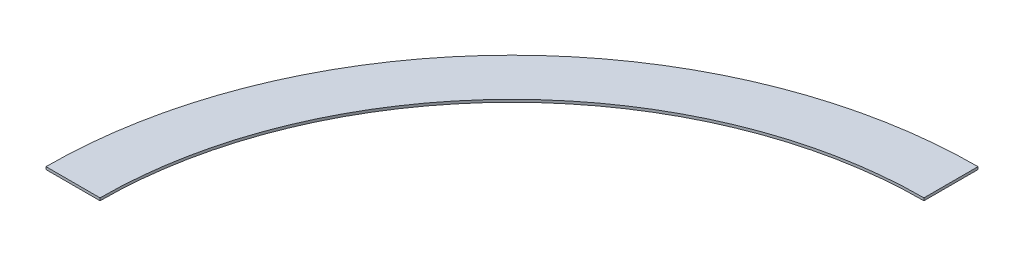
ISO-10303-21;
HEADER;
FILE_DESCRIPTION(('STEP AP214'),'2;1');
FILE_NAME('part.step','',(''),(''),'','','');
FILE_SCHEMA(('AUTOMOTIVE_DESIGN { 1 0 10303 214 1 1 1 1 }'));
ENDSEC;
DATA;
#1=APPLICATION_CONTEXT('core data for automotive mechanical design processes');
#2=APPLICATION_PROTOCOL_DEFINITION('international standard','automotive_design',2000,#1);
#3=PRODUCT_CONTEXT('',#1,'mechanical');
#4=PRODUCT('Part','Part','',(#3));
#5=PRODUCT_RELATED_PRODUCT_CATEGORY('part','',(#4));
#6=PRODUCT_DEFINITION_FORMATION('','',#4);
#7=PRODUCT_DEFINITION_CONTEXT('part definition',#1,'design');
#8=PRODUCT_DEFINITION('design','',#6,#7);
#9=PRODUCT_DEFINITION_SHAPE('','',#8);
#10=(LENGTH_UNIT() NAMED_UNIT(*) SI_UNIT(.MILLI.,.METRE.));
#11=(NAMED_UNIT(*) PLANE_ANGLE_UNIT() SI_UNIT($,.RADIAN.));
#12=(NAMED_UNIT(*) SI_UNIT($,.STERADIAN.) SOLID_ANGLE_UNIT());
#13=UNCERTAINTY_MEASURE_WITH_UNIT(LENGTH_MEASURE(1.E-05),#10,'distance_accuracy_value','');
#14=(GEOMETRIC_REPRESENTATION_CONTEXT(3) GLOBAL_UNCERTAINTY_ASSIGNED_CONTEXT((#13)) GLOBAL_UNIT_ASSIGNED_CONTEXT((#10,
#11,#12)) REPRESENTATION_CONTEXT('',''));
#15=CARTESIAN_POINT('',(0.,0.,0.));
#16=DIRECTION('',(0.,0.,1.));
#17=DIRECTION('',(1.,0.,0.));
#18=AXIS2_PLACEMENT_3D('',#15,#16,#17);
#19=CARTESIAN_POINT('',(0.,1.,0.));
#20=DIRECTION('',(1.,0.,0.));
#21=DIRECTION('',(0.,0.,-1.));
#22=AXIS2_PLACEMENT_3D('',#19,#20,#21);
#23=PLANE('',#22);
#24=DIRECTION('',(0.,0.,1.));
#25=VECTOR('',#24,1.);
#26=CARTESIAN_POINT('',(0.,0.,0.));
#27=LINE('',#26,#25);
#28=CARTESIAN_POINT('',(0.,0.,-181.));
#29=VERTEX_POINT('',#28);
#30=CARTESIAN_POINT('',(0.,0.,-160.));
#31=VERTEX_POINT('',#30);
#32=EDGE_CURVE('E98',#29,#31,#27,.T.);
#33=ORIENTED_EDGE('',*,*,#32,.F.);
#34=DIRECTION('',(0.,-1.,0.));
#35=VECTOR('',#34,1.);
#36=CARTESIAN_POINT('',(0.,1.,-181.));
#37=LINE('',#36,#35);
#38=CARTESIAN_POINT('',(0.,1.,-181.));
#39=VERTEX_POINT('',#38);
#40=EDGE_CURVE('E11',#39,#29,#37,.T.);
#41=ORIENTED_EDGE('',*,*,#40,.F.);
#42=DIRECTION('',(0.,0.,1.));
#43=VECTOR('',#42,1.);
#44=CARTESIAN_POINT('',(0.,1.,0.));
#45=LINE('',#44,#43);
#46=CARTESIAN_POINT('',(0.,1.,-160.));
#47=VERTEX_POINT('',#46);
#48=EDGE_CURVE('E83',#39,#47,#45,.T.);
#49=ORIENTED_EDGE('',*,*,#48,.T.);
#50=DIRECTION('',(0.,-1.,0.));
#51=VECTOR('',#50,1.);
#52=CARTESIAN_POINT('',(0.,1.,-160.));
#53=LINE('',#52,#51);
#54=EDGE_CURVE('E51',#47,#31,#53,.T.);
#55=ORIENTED_EDGE('',*,*,#54,.T.);
#56=EDGE_LOOP('',(#33,#41,#49,#55));
#57=FACE_BOUND('',#56,.T.);
#58=ADVANCED_FACE('F35',(#57),#23,.T.);
#59=CARTESIAN_POINT('',(0.,1.,0.));
#60=DIRECTION('',(0.,-1.,0.));
#61=DIRECTION('',(0.,0.,-1.));
#62=AXIS2_PLACEMENT_3D('',#59,#60,#61);
#63=CYLINDRICAL_SURFACE('',#62,181.);
#64=CARTESIAN_POINT('',(0.,0.,0.));
#65=DIRECTION('',(0.,1.,0.));
#66=DIRECTION('',(0.,0.,1.));
#67=AXIS2_PLACEMENT_3D('',#64,#65,#66);
#68=CIRCLE('',#67,181.);
#69=CARTESIAN_POINT('',(-181.,0.,0.));
#70=VERTEX_POINT('',#69);
#71=EDGE_CURVE('E89',#29,#70,#68,.T.);
#72=ORIENTED_EDGE('',*,*,#71,.T.);
#73=DIRECTION('',(0.,-1.,0.));
#74=VECTOR('',#73,1.);
#75=CARTESIAN_POINT('',(-181.,1.,0.));
#76=LINE('',#75,#74);
#77=CARTESIAN_POINT('',(-181.,1.,0.));
#78=VERTEX_POINT('',#77);
#79=EDGE_CURVE('E43',#78,#70,#76,.T.);
#80=ORIENTED_EDGE('',*,*,#79,.F.);
#81=CARTESIAN_POINT('',(0.,1.,0.));
#82=DIRECTION('',(0.,1.,0.));
#83=DIRECTION('',(0.,0.,1.));
#84=AXIS2_PLACEMENT_3D('',#81,#82,#83);
#85=CIRCLE('',#84,181.);
#86=EDGE_CURVE('E77',#39,#78,#85,.T.);
#87=ORIENTED_EDGE('',*,*,#86,.F.);
#88=ORIENTED_EDGE('',*,*,#40,.T.);
#89=EDGE_LOOP('',(#72,#80,#87,#88));
#90=FACE_BOUND('',#89,.T.);
#91=ADVANCED_FACE('F87',(#90),#63,.T.);
#92=CARTESIAN_POINT('',(0.,1.,0.));
#93=DIRECTION('',(0.,0.,1.));
#94=DIRECTION('',(1.,0.,0.));
#95=AXIS2_PLACEMENT_3D('',#92,#93,#94);
#96=PLANE('',#95);
#97=DIRECTION('',(-1.,0.,0.));
#98=VECTOR('',#97,1.);
#99=CARTESIAN_POINT('',(0.,0.,0.));
#100=LINE('',#99,#98);
#101=CARTESIAN_POINT('',(-160.,0.,0.));
#102=VERTEX_POINT('',#101);
#103=EDGE_CURVE('E101',#102,#70,#100,.T.);
#104=ORIENTED_EDGE('',*,*,#103,.F.);
#105=DIRECTION('',(0.,-1.,0.));
#106=VECTOR('',#105,1.);
#107=CARTESIAN_POINT('',(-160.,1.,0.));
#108=LINE('',#107,#106);
#109=CARTESIAN_POINT('',(-160.,1.,0.));
#110=VERTEX_POINT('',#109);
#111=EDGE_CURVE('E64',#110,#102,#108,.T.);
#112=ORIENTED_EDGE('',*,*,#111,.F.);
#113=DIRECTION('',(-1.,0.,0.));
#114=VECTOR('',#113,1.);
#115=CARTESIAN_POINT('',(0.,1.,0.));
#116=LINE('',#115,#114);
#117=EDGE_CURVE('E82',#110,#78,#116,.T.);
#118=ORIENTED_EDGE('',*,*,#117,.T.);
#119=ORIENTED_EDGE('',*,*,#79,.T.);
#120=EDGE_LOOP('',(#104,#112,#118,#119));
#121=FACE_BOUND('',#120,.T.);
#122=ADVANCED_FACE('F92',(#121),#96,.T.);
#123=CARTESIAN_POINT('',(0.,1.,0.));
#124=DIRECTION('',(0.,-1.,0.));
#125=DIRECTION('',(0.,0.,-1.));
#126=AXIS2_PLACEMENT_3D('',#123,#124,#125);
#127=CYLINDRICAL_SURFACE('',#126,160.);
#128=CARTESIAN_POINT('',(0.,0.,0.));
#129=DIRECTION('',(0.,1.,0.));
#130=DIRECTION('',(0.,0.,1.));
#131=AXIS2_PLACEMENT_3D('',#128,#129,#130);
#132=CIRCLE('',#131,160.);
#133=EDGE_CURVE('E103',#31,#102,#132,.T.);
#134=ORIENTED_EDGE('',*,*,#133,.F.);
#135=ORIENTED_EDGE('',*,*,#54,.F.);
#136=CARTESIAN_POINT('',(0.,1.,0.));
#137=DIRECTION('',(0.,1.,0.));
#138=DIRECTION('',(0.,0.,1.));
#139=AXIS2_PLACEMENT_3D('',#136,#137,#138);
#140=CIRCLE('',#139,160.);
#141=EDGE_CURVE('E93',#47,#110,#140,.T.);
#142=ORIENTED_EDGE('',*,*,#141,.T.);
#143=ORIENTED_EDGE('',*,*,#111,.T.);
#144=EDGE_LOOP('',(#134,#135,#142,#143));
#145=FACE_BOUND('',#144,.T.);
#146=ADVANCED_FACE('F108',(#145),#127,.F.);
#147=CARTESIAN_POINT('',(0.,1.,0.));
#148=DIRECTION('',(0.,1.,0.));
#149=DIRECTION('',(0.,0.,1.));
#150=AXIS2_PLACEMENT_3D('',#147,#148,#149);
#151=PLANE('',#150);
#152=ORIENTED_EDGE('',*,*,#48,.F.);
#153=ORIENTED_EDGE('',*,*,#86,.T.);
#154=ORIENTED_EDGE('',*,*,#117,.F.);
#155=ORIENTED_EDGE('',*,*,#141,.F.);
#156=EDGE_LOOP('',(#152,#153,#154,#155));
#157=FACE_BOUND('',#156,.T.);
#158=ADVANCED_FACE('F79',(#157),#151,.T.);
#159=CARTESIAN_POINT('',(0.,0.,0.));
#160=DIRECTION('',(0.,1.,0.));
#161=DIRECTION('',(0.,0.,1.));
#162=AXIS2_PLACEMENT_3D('',#159,#160,#161);
#163=PLANE('',#162);
#164=ORIENTED_EDGE('',*,*,#32,.T.);
#165=ORIENTED_EDGE('',*,*,#133,.T.);
#166=ORIENTED_EDGE('',*,*,#103,.T.);
#167=ORIENTED_EDGE('',*,*,#71,.F.);
#168=EDGE_LOOP('',(#164,#165,#166,#167));
#169=FACE_BOUND('',#168,.T.);
#170=ADVANCED_FACE('F115',(#169),#163,.F.);
#171=CLOSED_SHELL('',(#58,#91,#122,#146,#158,#170));
#172=MANIFOLD_SOLID_BREP('B2',#171);
#173=ADVANCED_BREP_SHAPE_REPRESENTATION('',(#18,#172),#14);
#174=SHAPE_DEFINITION_REPRESENTATION(#9,#173);
ENDSEC;
END-ISO-10303-21;
